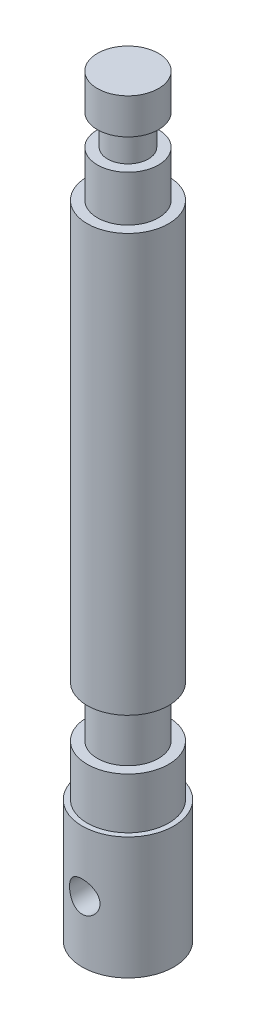
ISO-10303-21;
HEADER;
FILE_DESCRIPTION(('STEP AP214'),'2;1');
FILE_NAME('part.step','',(''),(''),'','','');
FILE_SCHEMA(('AUTOMOTIVE_DESIGN { 1 0 10303 214 1 1 1 1 }'));
ENDSEC;
DATA;
#1=APPLICATION_CONTEXT('core data for automotive mechanical design processes');
#2=APPLICATION_PROTOCOL_DEFINITION('international standard','automotive_design',2000,#1);
#3=PRODUCT_CONTEXT('',#1,'mechanical');
#4=PRODUCT('Part','Part','',(#3));
#5=PRODUCT_RELATED_PRODUCT_CATEGORY('part','',(#4));
#6=PRODUCT_DEFINITION_FORMATION('','',#4);
#7=PRODUCT_DEFINITION_CONTEXT('part definition',#1,'design');
#8=PRODUCT_DEFINITION('design','',#6,#7);
#9=PRODUCT_DEFINITION_SHAPE('','',#8);
#10=(LENGTH_UNIT() NAMED_UNIT(*) SI_UNIT(.MILLI.,.METRE.));
#11=(NAMED_UNIT(*) PLANE_ANGLE_UNIT() SI_UNIT($,.RADIAN.));
#12=(NAMED_UNIT(*) SI_UNIT($,.STERADIAN.) SOLID_ANGLE_UNIT());
#13=UNCERTAINTY_MEASURE_WITH_UNIT(LENGTH_MEASURE(1.E-05),#10,'distance_accuracy_value','');
#14=(GEOMETRIC_REPRESENTATION_CONTEXT(3) GLOBAL_UNCERTAINTY_ASSIGNED_CONTEXT((#13)) GLOBAL_UNIT_ASSIGNED_CONTEXT((#10,
#11,#12)) REPRESENTATION_CONTEXT('',''));
#15=CARTESIAN_POINT('',(0.,0.,0.));
#16=DIRECTION('',(0.,0.,1.));
#17=DIRECTION('',(1.,0.,0.));
#18=AXIS2_PLACEMENT_3D('',#15,#16,#17);
#19=CARTESIAN_POINT('',(0.,24.,0.));
#20=DIRECTION('',(0.,-1.,0.));
#21=DIRECTION('',(0.,0.,-1.));
#22=AXIS2_PLACEMENT_3D('',#19,#20,#21);
#23=CYLINDRICAL_SURFACE('',#22,9.);
#24=CARTESIAN_POINT('',(0.,15.,-9.));
#25=CARTESIAN_POINT('',(-0.16369008866017,15.0000007611949,-9.00000045902832));
#26=CARTESIAN_POINT('',(-0.32737558361565,14.9865592016184,-8.99549308522634));
#27=CARTESIAN_POINT('',(-0.649925282618917,14.9333126735483,-8.97795630609842));
#28=CARTESIAN_POINT('',(-0.808788984356453,14.8935049681532,-8.96492601606458));
#29=CARTESIAN_POINT('',(-1.11699836850533,14.7890422698479,-8.93175923719328));
#30=CARTESIAN_POINT('',(-1.2663594776581,14.7244288126222,-8.9116346319256));
#31=CARTESIAN_POINT('',(-1.55212481041597,14.572376481485,-8.86633337152025));
#32=CARTESIAN_POINT('',(-1.68852647087612,14.4849331049922,-8.84115572003334));
#33=CARTESIAN_POINT('',(-1.9492250250668,14.2865225854237,-8.78742283329015));
#34=CARTESIAN_POINT('',(-2.07301110089493,14.1749062972185,-8.75878669391354));
#35=CARTESIAN_POINT('',(-2.30049807810625,13.9326985358803,-8.70180944349364));
#36=CARTESIAN_POINT('',(-2.40419455646839,13.8021028952145,-8.67346839871647));
#37=CARTESIAN_POINT('',(-2.59147482668358,13.5210446544106,-8.61939997431821));
#38=CARTESIAN_POINT('',(-2.6743945746631,13.3701187808036,-8.59377117827064));
#39=CARTESIAN_POINT('',(-2.81345662163317,13.0554717166244,-8.54925916255803));
#40=CARTESIAN_POINT('',(-2.8696070921603,12.8917544485118,-8.53037388482237));
#41=CARTESIAN_POINT('',(-2.95162038452749,12.5619803355099,-8.50233909808132));
#42=CARTESIAN_POINT('',(-2.97844034481531,12.3961883745328,-8.49288287308834));
#43=CARTESIAN_POINT('',(-3.00402337000343,12.0622087375324,-8.48386969888523));
#44=CARTESIAN_POINT('',(-3.00279510481416,11.8940218178724,-8.4843096906819));
#45=CARTESIAN_POINT('',(-2.97305971111026,11.5681901086679,-8.4947704502454));
#46=CARTESIAN_POINT('',(-2.94580173950098,11.4104147912429,-8.50435247602599));
#47=CARTESIAN_POINT('',(-2.86681848854825,11.1018197411795,-8.53129973173653));
#48=CARTESIAN_POINT('',(-2.81509027977561,10.9510008436948,-8.54866589352323));
#49=CARTESIAN_POINT('',(-2.68781717418063,10.6577617512256,-8.58953733393746));
#50=CARTESIAN_POINT('',(-2.61190214612179,10.5155159235914,-8.61313697379352));
#51=CARTESIAN_POINT('',(-2.43866731890942,10.2453872751608,-8.66377675727179));
#52=CARTESIAN_POINT('',(-2.34134133709202,10.1175086191999,-8.69081789371391));
#53=CARTESIAN_POINT('',(-2.12204799804671,9.87272520551768,-8.74701987503223));
#54=CARTESIAN_POINT('',(-1.99905945022893,9.75674191647279,-8.77621768064528));
#55=CARTESIAN_POINT('',(-1.73501870991019,9.54680620000981,-8.8322081516111));
#56=CARTESIAN_POINT('',(-1.59396478698244,9.45285588550651,-8.85900058614202));
#57=CARTESIAN_POINT('',(-1.2958428391388,9.28891109929479,-8.90751323813381));
#58=CARTESIAN_POINT('',(-1.13862982924901,9.2191635259778,-8.92918050024118));
#59=CARTESIAN_POINT('',(-0.813807250093522,9.10739047813287,-8.96461701433304));
#60=CARTESIAN_POINT('',(-0.64620131446486,9.06535537372969,-8.97838900964638));
#61=CARTESIAN_POINT('',(-0.313151488587911,9.01183300193292,-8.99602881214321));
#62=CARTESIAN_POINT('',(-0.147928799594537,8.99910057248175,-9.00030005501184));
#63=CARTESIAN_POINT('',(0.182325209880714,9.00099802079541,-8.99966708084482));
#64=CARTESIAN_POINT('',(0.347356557958953,9.01562327993963,-8.99476441258087));
#65=CARTESIAN_POINT('',(0.667559598912768,9.07083572320788,-8.97660074151313));
#66=CARTESIAN_POINT('',(0.822878420504532,9.11065861814848,-8.96358596133577));
#67=CARTESIAN_POINT('',(1.12456787573872,9.21418033340019,-8.9307554049021));
#68=CARTESIAN_POINT('',(1.27093736552582,9.27788219840336,-8.91093876140025));
#69=CARTESIAN_POINT('',(1.55486488917982,9.42921129552236,-8.86586793861869));
#70=CARTESIAN_POINT('',(1.69208987765144,9.51742377984951,-8.84048444267358));
#71=CARTESIAN_POINT('',(1.95019449040676,9.71458245004045,-8.78715761748787));
#72=CARTESIAN_POINT('',(2.07106910338673,9.8235349680953,-8.75921350781483));
#73=CARTESIAN_POINT('',(2.2987575234189,10.0649362530198,-8.70230543941334));
#74=CARTESIAN_POINT('',(2.40468290773731,10.1982276807806,-8.67335283262283));
#75=CARTESIAN_POINT('',(2.59277256697072,10.4813147034327,-8.61899919884126));
#76=CARTESIAN_POINT('',(2.67493664379304,10.6311104359022,-8.59359820146007));
#77=CARTESIAN_POINT('',(2.81279079124908,10.9430190458697,-8.54947175374151));
#78=CARTESIAN_POINT('',(2.86853439649506,11.1051062375063,-8.53073282378936));
#79=CARTESIAN_POINT('',(2.95168400027807,11.4371359501324,-8.50232496919349));
#80=CARTESIAN_POINT('',(2.97910276486182,11.607074896213,-8.49265195870918));
#81=CARTESIAN_POINT('',(3.00382884743203,11.9405912881228,-8.48393576622531));
#82=CARTESIAN_POINT('',(3.0026107719252,12.1040470208605,-8.48437200772245));
#83=CARTESIAN_POINT('',(2.97372688034608,12.4282952247662,-8.49453809471602));
#84=CARTESIAN_POINT('',(2.94606263837576,12.5890878538653,-8.50426738708085));
#85=CARTESIAN_POINT('',(2.86611543938804,12.9004069890074,-8.53153572914675));
#86=CARTESIAN_POINT('',(2.81431003804654,13.0510704750135,-8.54892294067432));
#87=CARTESIAN_POINT('',(2.68793809727924,13.3416822208148,-8.58949196455405));
#88=CARTESIAN_POINT('',(2.61336650566142,13.481628093564,-8.61267506290179));
#89=CARTESIAN_POINT('',(2.43978207775029,13.7534510097687,-8.66348487678139));
#90=CARTESIAN_POINT('',(2.33984472829374,13.8847095056952,-8.69126134926411));
#91=CARTESIAN_POINT('',(2.11992864940695,14.1290694401526,-8.74750068849758));
#92=CARTESIAN_POINT('',(1.99994425335444,14.2421657270642,-8.77596374737117));
#93=CARTESIAN_POINT('',(1.73772467076206,14.4514332368675,-8.83170091576632));
#94=CARTESIAN_POINT('',(1.59480454049919,14.546773043253,-8.8588854540377));
#95=CARTESIAN_POINT('',(1.29407207221987,14.7119712865519,-8.90777973517836));
#96=CARTESIAN_POINT('',(1.13626355439704,14.7818362377661,-8.9294908772379));
#97=CARTESIAN_POINT('',(0.817480941602927,14.891164897466,-8.96416545205626));
#98=CARTESIAN_POINT('',(0.656963273029226,14.9318473987901,-8.97747637267568));
#99=CARTESIAN_POINT('',(0.330961248030742,14.9862608420314,-8.99539221192665));
#100=CARTESIAN_POINT('',(0.16547827670624,14.9999992304896,-8.99999953595715));
#101=CARTESIAN_POINT('',(0.,15.,-9.));
#102=B_SPLINE_CURVE_WITH_KNOTS('',3,(#24,#25,#26,#27,#28,#29,#30,#31,#32,#33,#34,#35,#36,#37,
#38,#39,#40,#41,#42,#43,#44,#45,#46,#47,#48,#49,#50,#51,#52,#53,#54,#55,#56,#57,#58,#59,#60,#61,
#62,#63,#64,#65,#66,#67,#68,#69,#70,#71,#72,#73,#74,#75,#76,#77,#78,#79,#80,#81,#82,#83,#84,#85,
#86,#87,#88,#89,#90,#91,#92,#93,#94,#95,#96,#97,#98,#99,#100,#101),.UNSPECIFIED.,.T.,.F.,(4,2,2,
2,2,2,2,2,2,2,2,2,2,2,2,2,2,2,2,2,2,2,2,2,2,2,2,2,2,2,2,2,2,2,2,2,2,2,4),(0.,0.490461318078033,
0.980973555802562,1.47066801861082,1.9604591333973,2.46554052848268,2.97073299862591,
3.49045154470412,4.010011340785,4.5120577722552,5.01394901962456,5.49290479653841,
5.97191792566446,6.45864513465392,6.94551307674622,7.45779917434101,7.97013437899855,
8.48755216951073,9.00479006631625,9.49960749525509,9.9943413949253,10.4747447393464,
10.9552093585231,11.4483119953121,11.9415654246567,12.4572306864226,12.9729002470499,
13.4875204148031,14.0019085411752,14.4898699819277,14.9778023805413,15.4564676124125,
15.9352391452793,16.4349020007541,16.9347063337134,17.453989825053,17.9731404345737,
18.4690967512144,18.9649159811442),.UNSPECIFIED.);
#103=CARTESIAN_POINT('',(0.,15.,-9.));
#104=VERTEX_POINT('',#103);
#105=EDGE_CURVE('E10',#104,#104,#102,.T.);
#106=ORIENTED_EDGE('',*,*,#105,.T.);
#107=EDGE_LOOP('',(#106));
#108=FACE_BOUND('',#107,.T.);
#109=CARTESIAN_POINT('',(3.,12.,8.48528137423857));
#110=CARTESIAN_POINT('',(3.00000077384314,11.8365954754918,8.48528083591302));
#111=CARTESIAN_POINT('',(2.98660435105657,11.6731956005292,8.49005307872572));
#112=CARTESIAN_POINT('',(2.93355339506643,11.3512367370173,8.50852722243764));
#113=CARTESIAN_POINT('',(2.89389453650519,11.1926785503826,8.52223059426566));
#114=CARTESIAN_POINT('',(2.78986645705471,10.8851193210081,8.55684611066375));
#115=CARTESIAN_POINT('',(2.72554566420974,10.7361002116718,8.57774411913965));
#116=CARTESIAN_POINT('',(2.57418488532414,10.4509198543561,8.62437366030974));
#117=CARTESIAN_POINT('',(2.48713988658055,10.3147614523391,8.65010625910837));
#118=CARTESIAN_POINT('',(2.28915343932863,10.0538401129851,8.70463468222419));
#119=CARTESIAN_POINT('',(2.17747302413376,9.92965371398481,8.73350684533932));
#120=CARTESIAN_POINT('',(1.93496300164318,9.70137959632608,8.79041594403009));
#121=CARTESIAN_POINT('',(1.80413032515713,9.59729510525289,8.81845274486885));
#122=CARTESIAN_POINT('',(1.52281352389503,9.40956330801122,8.87141600765397));
#123=CARTESIAN_POINT('',(1.37190573367357,9.32652008814613,8.89624223104816));
#124=CARTESIAN_POINT('',(1.05729366896242,9.18722524461747,8.93908760312949));
#125=CARTESIAN_POINT('',(0.893592857061635,9.13096640046928,8.95710858609006));
#126=CARTESIAN_POINT('',(0.564086452300483,9.04879243610282,8.9837722629572));
#127=CARTESIAN_POINT('',(0.398552264558905,9.02188966122898,8.99271944332677));
#128=CARTESIAN_POINT('',(0.0650936244722681,8.99605111991802,9.00130824654744));
#129=CARTESIAN_POINT('',(-0.10283020063169,8.99710814504276,9.00095226788686));
#130=CARTESIAN_POINT('',(-0.429310545581445,9.02653276369808,8.99118118856194));
#131=CARTESIAN_POINT('',(-0.58797614577497,9.05382758542346,8.98212194265352));
#132=CARTESIAN_POINT('',(-0.898330316466515,9.13317894294142,8.95640902019194));
#133=CARTESIAN_POINT('',(-1.05001841333765,9.18523715693947,8.93975482893545));
#134=CARTESIAN_POINT('',(-1.34445742452592,9.31326395191818,8.90027010879673));
#135=CARTESIAN_POINT('',(-1.48706466290653,9.38953781563954,8.87736127572046));
#136=CARTESIAN_POINT('',(-1.75777297658197,9.56357911634597,8.82775179116757));
#137=CARTESIAN_POINT('',(-1.88587000315602,9.66135252998289,8.801050086044));
#138=CARTESIAN_POINT('',(-2.13030259965392,9.8810231803791,8.7451857554969));
#139=CARTESIAN_POINT('',(-2.24580047119582,10.0038394735244,8.71596645506633));
#140=CARTESIAN_POINT('',(-2.45483177879452,10.2673461771799,8.65942005746702));
#141=CARTESIAN_POINT('',(-2.54836182984463,10.4080393371841,8.63209325236846));
#142=CARTESIAN_POINT('',(-2.71196236510723,10.7059608768103,8.58211575363337));
#143=CARTESIAN_POINT('',(-2.78167939086402,10.8633963939533,8.55953727854243));
#144=CARTESIAN_POINT('',(-2.89332957980801,11.1887141826433,8.52244952473154));
#145=CARTESIAN_POINT('',(-2.93527438724248,11.3565920436187,8.50793686461278));
#146=CARTESIAN_POINT('',(-2.98848384629256,11.6899150662347,8.48938908946755));
#147=CARTESIAN_POINT('',(-3.0010472865229,11.855128274246,8.48491080956268));
#148=CARTESIAN_POINT('',(-2.99881631672916,12.1853284473423,8.48570016177553));
#149=CARTESIAN_POINT('',(-2.98402687568029,12.350315448072,8.49096602375443));
#150=CARTESIAN_POINT('',(-2.92867695465693,12.6694708971357,8.51020854270898));
#151=CARTESIAN_POINT('',(-2.88901918194205,12.8238162904525,8.52387976322521));
#152=CARTESIAN_POINT('',(-2.7861415876814,13.1236308187176,8.55805661013069));
#153=CARTESIAN_POINT('',(-2.72291758909027,13.2690983747723,8.57856344804518));
#154=CARTESIAN_POINT('',(-2.57242302221681,13.552141262541,8.6249063278736));
#155=CARTESIAN_POINT('',(-2.48445335507549,13.6893199279254,8.65089076996885));
#156=CARTESIAN_POINT('',(-2.28775689167268,13.9474381571512,8.70497306192896));
#157=CARTESIAN_POINT('',(-2.17902397649635,14.0683729159837,8.73307153331383));
#158=CARTESIAN_POINT('',(-1.93767511770098,14.2965839522719,8.78985115913547));
#159=CARTESIAN_POINT('',(-1.80416181163996,14.4029231700565,8.81849530733689));
#160=CARTESIAN_POINT('',(-1.52048187420077,14.5917484270441,8.87180554839326));
#161=CARTESIAN_POINT('',(-1.37031583459366,14.6742353134873,8.89647178253084));
#162=CARTESIAN_POINT('',(-1.05833958729689,14.8122603145851,8.93893217431809));
#163=CARTESIAN_POINT('',(-0.896613369963591,14.8679738314442,8.95677090013593));
#164=CARTESIAN_POINT('',(-0.56537539753805,14.9511832261803,8.98375832513324));
#165=CARTESIAN_POINT('',(-0.395866475861669,14.9786892896415,8.99291016102056));
#166=CARTESIAN_POINT('',(-0.0624460075801243,15.0037862328169,9.00125589708769));
#167=CARTESIAN_POINT('',(0.101354171760054,15.0027223617971,9.00089760268317));
#168=CARTESIAN_POINT('',(0.42633343500052,14.9740280755608,8.99136589558194));
#169=CARTESIAN_POINT('',(0.587512730457169,14.9463998155417,8.98219319800727));
#170=CARTESIAN_POINT('',(0.900126358296175,14.8662532962721,8.95622744863237));
#171=CARTESIAN_POINT('',(1.05167481273837,14.8141373539412,8.93955775083445));
#172=CARTESIAN_POINT('',(1.34393505281939,14.6868674067085,8.90031482113485));
#173=CARTESIAN_POINT('',(1.4846448724273,14.611709234409,8.87774052144049));
#174=CARTESIAN_POINT('',(1.75690204892636,14.437291463694,8.82797606483643));
#175=CARTESIAN_POINT('',(1.88791875467282,14.3372439438551,8.80064617475779));
#176=CARTESIAN_POINT('',(2.13174307881728,14.1172278265314,8.74478966375638));
#177=CARTESIAN_POINT('',(2.24454486487378,13.9972528732118,8.71626266319291));
#178=CARTESIAN_POINT('',(2.45322542649935,13.7351719332392,8.65989839476794));
#179=CARTESIAN_POINT('',(2.5482688979937,13.5923834670701,8.63213183965892));
#180=CARTESIAN_POINT('',(2.71294302990334,13.2919967192917,8.58180579969046));
#181=CARTESIAN_POINT('',(2.78258033045842,13.134402320911,8.55924495483748));
#182=CARTESIAN_POINT('',(2.8915314846125,12.8161145279531,8.52304002619544));
#183=CARTESIAN_POINT('',(2.93207372744856,12.6558832094239,8.50903898571547));
#184=CARTESIAN_POINT('',(2.9863029604478,12.3304318485999,8.49016150618554));
#185=CARTESIAN_POINT('',(2.99999921758978,12.1652135477679,8.48528191852383));
#186=CARTESIAN_POINT('',(3.,12.,8.48528137423857));
#187=B_SPLINE_CURVE_WITH_KNOTS('',3,(#109,#110,#111,#112,#113,#114,#115,#116,#117,#118,#119,
#120,#121,#122,#123,#124,#125,#126,#127,#128,#129,#130,#131,#132,#133,#134,#135,#136,#137,#138,
#139,#140,#141,#142,#143,#144,#145,#146,#147,#148,#149,#150,#151,#152,#153,#154,#155,#156,#157,
#158,#159,#160,#161,#162,#163,#164,#165,#166,#167,#168,#169,#170,#171,#172,#173,#174,#175,#176,
#177,#178,#179,#180,#181,#182,#183,#184,#185,#186),.UNSPECIFIED.,.T.,.F.,(4,2,2,2,2,2,2,2,2,2,2,
2,2,2,2,2,2,2,2,2,2,2,2,2,2,2,2,2,2,2,2,2,2,2,2,2,2,2,4),(0.,0.489601754398066,
0.979284165045492,1.46800988250249,1.95684349855633,2.46304012282705,2.96931795515964,
3.48880518430972,4.00815229160367,4.50942956294803,5.01057759906982,5.49207014476707,
5.9735953256771,6.46144964581005,6.94943975622066,7.46040523091753,7.97144938836318,
8.48977919529167,9.00789154069847,9.50262874093318,9.99727607511701,10.4749318730633,
10.9526723744084,11.4455657320714,11.9386045698638,12.4553642451328,12.972105562726,
13.4854137357255,13.9985364901247,14.4875425403291,14.9765089202934,15.4577086812129,
15.9389955228973,16.438065585619,16.9372951329789,17.4560670820843,17.974703348006,
18.4698963648807,18.9649184157139),.UNSPECIFIED.);
#188=CARTESIAN_POINT('',(3.,12.,8.48528137423857));
#189=VERTEX_POINT('',#188);
#190=EDGE_CURVE('E46',#189,#189,#187,.T.);
#191=ORIENTED_EDGE('',*,*,#190,.T.);
#192=EDGE_LOOP('',(#191));
#193=FACE_BOUND('',#192,.T.);
#194=CARTESIAN_POINT('',(0.,24.,0.));
#195=DIRECTION('',(0.,1.,0.));
#196=DIRECTION('',(0.,0.,1.));
#197=AXIS2_PLACEMENT_3D('',#194,#195,#196);
#198=CIRCLE('',#197,9.);
#199=CARTESIAN_POINT('',(0.,24.,9.));
#200=VERTEX_POINT('',#199);
#201=EDGE_CURVE('E132',#200,#200,#198,.T.);
#202=ORIENTED_EDGE('',*,*,#201,.F.);
#203=EDGE_LOOP('',(#202));
#204=FACE_BOUND('',#203,.T.);
#205=CARTESIAN_POINT('',(0.,0.,0.));
#206=DIRECTION('',(0.,1.,0.));
#207=DIRECTION('',(0.,0.,1.));
#208=AXIS2_PLACEMENT_3D('',#205,#206,#207);
#209=CIRCLE('',#208,9.);
#210=CARTESIAN_POINT('',(0.,0.,9.));
#211=VERTEX_POINT('',#210);
#212=EDGE_CURVE('E60',#211,#211,#209,.T.);
#213=ORIENTED_EDGE('',*,*,#212,.T.);
#214=EDGE_LOOP('',(#213));
#215=FACE_BOUND('',#214,.T.);
#216=ADVANCED_FACE('F35',(#108,#193,#204,#215),#23,.T.);
#217=CARTESIAN_POINT('',(0.,24.,0.));
#218=DIRECTION('',(0.,1.,0.));
#219=DIRECTION('',(0.,0.,1.));
#220=AXIS2_PLACEMENT_3D('',#217,#218,#219);
#221=PLANE('',#220);
#222=CARTESIAN_POINT('',(0.,24.,0.));
#223=DIRECTION('',(0.,1.,0.));
#224=DIRECTION('',(0.,0.,1.));
#225=AXIS2_PLACEMENT_3D('',#222,#223,#224);
#226=CIRCLE('',#225,8.);
#227=CARTESIAN_POINT('',(0.,24.,8.));
#228=VERTEX_POINT('',#227);
#229=EDGE_CURVE('E135',#228,#228,#226,.T.);
#230=ORIENTED_EDGE('',*,*,#229,.F.);
#231=EDGE_LOOP('',(#230));
#232=FACE_BOUND('',#231,.T.);
#233=ORIENTED_EDGE('',*,*,#201,.T.);
#234=EDGE_LOOP('',(#233));
#235=FACE_BOUND('',#234,.T.);
#236=ADVANCED_FACE('F117',(#232,#235),#221,.T.);
#237=CARTESIAN_POINT('',(0.,0.,0.));
#238=DIRECTION('',(0.,1.,0.));
#239=DIRECTION('',(0.,0.,1.));
#240=AXIS2_PLACEMENT_3D('',#237,#238,#239);
#241=PLANE('',#240);
#242=ORIENTED_EDGE('',*,*,#212,.F.);
#243=EDGE_LOOP('',(#242));
#244=FACE_BOUND('',#243,.T.);
#245=ADVANCED_FACE('F115',(#244),#241,.F.);
#246=CARTESIAN_POINT('',(0.,34.,0.));
#247=DIRECTION('',(0.,-1.,0.));
#248=DIRECTION('',(0.,0.,-1.));
#249=AXIS2_PLACEMENT_3D('',#246,#247,#248);
#250=CYLINDRICAL_SURFACE('',#249,8.);
#251=CARTESIAN_POINT('',(0.,34.,0.));
#252=DIRECTION('',(0.,1.,0.));
#253=DIRECTION('',(0.,0.,1.));
#254=AXIS2_PLACEMENT_3D('',#251,#252,#253);
#255=CIRCLE('',#254,8.);
#256=CARTESIAN_POINT('',(0.,34.,8.));
#257=VERTEX_POINT('',#256);
#258=EDGE_CURVE('E134',#257,#257,#255,.T.);
#259=ORIENTED_EDGE('',*,*,#258,.F.);
#260=EDGE_LOOP('',(#259));
#261=FACE_BOUND('',#260,.T.);
#262=ORIENTED_EDGE('',*,*,#229,.T.);
#263=EDGE_LOOP('',(#262));
#264=FACE_BOUND('',#263,.T.);
#265=ADVANCED_FACE('F111',(#261,#264),#250,.T.);
#266=CARTESIAN_POINT('',(0.,34.,0.));
#267=DIRECTION('',(0.,1.,0.));
#268=DIRECTION('',(0.,0.,1.));
#269=AXIS2_PLACEMENT_3D('',#266,#267,#268);
#270=PLANE('',#269);
#271=CARTESIAN_POINT('',(0.,34.,0.));
#272=DIRECTION('',(0.,1.,0.));
#273=DIRECTION('',(0.,0.,1.));
#274=AXIS2_PLACEMENT_3D('',#271,#272,#273);
#275=CIRCLE('',#274,6.);
#276=CARTESIAN_POINT('',(0.,34.,6.));
#277=VERTEX_POINT('',#276);
#278=EDGE_CURVE('E146',#277,#277,#275,.T.);
#279=ORIENTED_EDGE('',*,*,#278,.F.);
#280=EDGE_LOOP('',(#279));
#281=FACE_BOUND('',#280,.T.);
#282=ORIENTED_EDGE('',*,*,#258,.T.);
#283=EDGE_LOOP('',(#282));
#284=FACE_BOUND('',#283,.T.);
#285=ADVANCED_FACE('F107',(#281,#284),#270,.T.);
#286=CARTESIAN_POINT('',(0.,44.,0.));
#287=DIRECTION('',(0.,-1.,0.));
#288=DIRECTION('',(0.,0.,-1.));
#289=AXIS2_PLACEMENT_3D('',#286,#287,#288);
#290=CYLINDRICAL_SURFACE('',#289,6.);
#291=CARTESIAN_POINT('',(0.,44.,0.));
#292=DIRECTION('',(0.,1.,0.));
#293=DIRECTION('',(0.,0.,1.));
#294=AXIS2_PLACEMENT_3D('',#291,#292,#293);
#295=CIRCLE('',#294,6.);
#296=CARTESIAN_POINT('',(0.,44.,6.));
#297=VERTEX_POINT('',#296);
#298=EDGE_CURVE('E137',#297,#297,#295,.T.);
#299=ORIENTED_EDGE('',*,*,#298,.F.);
#300=EDGE_LOOP('',(#299));
#301=FACE_BOUND('',#300,.T.);
#302=ORIENTED_EDGE('',*,*,#278,.T.);
#303=EDGE_LOOP('',(#302));
#304=FACE_BOUND('',#303,.T.);
#305=ADVANCED_FACE('F103',(#301,#304),#290,.T.);
#306=CARTESIAN_POINT('',(0.,126.,0.));
#307=DIRECTION('',(0.,-1.,0.));
#308=DIRECTION('',(0.,0.,-1.));
#309=AXIS2_PLACEMENT_3D('',#306,#307,#308);
#310=CYLINDRICAL_SURFACE('',#309,8.);
#311=CARTESIAN_POINT('',(0.,126.,0.));
#312=DIRECTION('',(0.,1.,0.));
#313=DIRECTION('',(0.,0.,1.));
#314=AXIS2_PLACEMENT_3D('',#311,#312,#313);
#315=CIRCLE('',#314,8.);
#316=CARTESIAN_POINT('',(0.,126.,8.));
#317=VERTEX_POINT('',#316);
#318=EDGE_CURVE('E142',#317,#317,#315,.T.);
#319=ORIENTED_EDGE('',*,*,#318,.F.);
#320=EDGE_LOOP('',(#319));
#321=FACE_BOUND('',#320,.T.);
#322=CARTESIAN_POINT('',(0.,44.,0.));
#323=DIRECTION('',(0.,1.,0.));
#324=DIRECTION('',(0.,0.,1.));
#325=AXIS2_PLACEMENT_3D('',#322,#323,#324);
#326=CIRCLE('',#325,8.);
#327=CARTESIAN_POINT('',(0.,44.,8.));
#328=VERTEX_POINT('',#327);
#329=EDGE_CURVE('E162',#328,#328,#326,.T.);
#330=ORIENTED_EDGE('',*,*,#329,.T.);
#331=EDGE_LOOP('',(#330));
#332=FACE_BOUND('',#331,.T.);
#333=ADVANCED_FACE('F96',(#321,#332),#310,.T.);
#334=CARTESIAN_POINT('',(0.,126.,0.));
#335=DIRECTION('',(0.,1.,0.));
#336=DIRECTION('',(0.,0.,1.));
#337=AXIS2_PLACEMENT_3D('',#334,#335,#336);
#338=PLANE('',#337);
#339=CARTESIAN_POINT('',(0.,126.,0.));
#340=DIRECTION('',(0.,1.,0.));
#341=DIRECTION('',(0.,0.,1.));
#342=AXIS2_PLACEMENT_3D('',#339,#340,#341);
#343=CIRCLE('',#342,6.);
#344=CARTESIAN_POINT('',(0.,126.,6.));
#345=VERTEX_POINT('',#344);
#346=EDGE_CURVE('E54',#345,#345,#343,.T.);
#347=ORIENTED_EDGE('',*,*,#346,.F.);
#348=EDGE_LOOP('',(#347));
#349=FACE_BOUND('',#348,.T.);
#350=ORIENTED_EDGE('',*,*,#318,.T.);
#351=EDGE_LOOP('',(#350));
#352=FACE_BOUND('',#351,.T.);
#353=ADVANCED_FACE('F93',(#349,#352),#338,.T.);
#354=CARTESIAN_POINT('',(0.,44.,0.));
#355=DIRECTION('',(0.,1.,0.));
#356=DIRECTION('',(0.,0.,1.));
#357=AXIS2_PLACEMENT_3D('',#354,#355,#356);
#358=PLANE('',#357);
#359=ORIENTED_EDGE('',*,*,#298,.T.);
#360=EDGE_LOOP('',(#359));
#361=FACE_BOUND('',#360,.T.);
#362=ORIENTED_EDGE('',*,*,#329,.F.);
#363=EDGE_LOOP('',(#362));
#364=FACE_BOUND('',#363,.T.);
#365=ADVANCED_FACE('F91',(#361,#364),#358,.F.);
#366=CARTESIAN_POINT('',(0.,135.,0.));
#367=DIRECTION('',(0.,-1.,0.));
#368=DIRECTION('',(0.,0.,-1.));
#369=AXIS2_PLACEMENT_3D('',#366,#367,#368);
#370=CYLINDRICAL_SURFACE('',#369,6.);
#371=CARTESIAN_POINT('',(0.,135.,0.));
#372=DIRECTION('',(0.,1.,0.));
#373=DIRECTION('',(0.,0.,1.));
#374=AXIS2_PLACEMENT_3D('',#371,#372,#373);
#375=CIRCLE('',#374,6.);
#376=CARTESIAN_POINT('',(0.,135.,6.));
#377=VERTEX_POINT('',#376);
#378=EDGE_CURVE('E159',#377,#377,#375,.T.);
#379=ORIENTED_EDGE('',*,*,#378,.F.);
#380=EDGE_LOOP('',(#379));
#381=FACE_BOUND('',#380,.T.);
#382=ORIENTED_EDGE('',*,*,#346,.T.);
#383=EDGE_LOOP('',(#382));
#384=FACE_BOUND('',#383,.T.);
#385=ADVANCED_FACE('F87',(#381,#384),#370,.T.);
#386=CARTESIAN_POINT('',(0.,135.,0.));
#387=DIRECTION('',(0.,1.,0.));
#388=DIRECTION('',(0.,0.,1.));
#389=AXIS2_PLACEMENT_3D('',#386,#387,#388);
#390=PLANE('',#389);
#391=CARTESIAN_POINT('',(0.,135.,0.));
#392=DIRECTION('',(0.,1.,0.));
#393=DIRECTION('',(0.,0.,1.));
#394=AXIS2_PLACEMENT_3D('',#391,#392,#393);
#395=CIRCLE('',#394,4.);
#396=CARTESIAN_POINT('',(0.,135.,4.));
#397=VERTEX_POINT('',#396);
#398=EDGE_CURVE('E50',#397,#397,#395,.T.);
#399=ORIENTED_EDGE('',*,*,#398,.F.);
#400=EDGE_LOOP('',(#399));
#401=FACE_BOUND('',#400,.T.);
#402=ORIENTED_EDGE('',*,*,#378,.T.);
#403=EDGE_LOOP('',(#402));
#404=FACE_BOUND('',#403,.T.);
#405=ADVANCED_FACE('F83',(#401,#404),#390,.T.);
#406=CARTESIAN_POINT('',(0.,141.,0.));
#407=DIRECTION('',(0.,-1.,0.));
#408=DIRECTION('',(0.,0.,-1.));
#409=AXIS2_PLACEMENT_3D('',#406,#407,#408);
#410=CYLINDRICAL_SURFACE('',#409,4.);
#411=CARTESIAN_POINT('',(0.,141.,0.));
#412=DIRECTION('',(0.,1.,0.));
#413=DIRECTION('',(0.,0.,1.));
#414=AXIS2_PLACEMENT_3D('',#411,#412,#413);
#415=CIRCLE('',#414,4.);
#416=CARTESIAN_POINT('',(0.,141.,4.));
#417=VERTEX_POINT('',#416);
#418=EDGE_CURVE('E167',#417,#417,#415,.T.);
#419=ORIENTED_EDGE('',*,*,#418,.F.);
#420=EDGE_LOOP('',(#419));
#421=FACE_BOUND('',#420,.T.);
#422=ORIENTED_EDGE('',*,*,#398,.T.);
#423=EDGE_LOOP('',(#422));
#424=FACE_BOUND('',#423,.T.);
#425=ADVANCED_FACE('F79',(#421,#424),#410,.T.);
#426=CARTESIAN_POINT('',(0.,148.,0.));
#427=DIRECTION('',(0.,-1.,0.));
#428=DIRECTION('',(0.,0.,-1.));
#429=AXIS2_PLACEMENT_3D('',#426,#427,#428);
#430=CYLINDRICAL_SURFACE('',#429,6.);
#431=CARTESIAN_POINT('',(0.,148.,0.));
#432=DIRECTION('',(0.,1.,0.));
#433=DIRECTION('',(0.,0.,1.));
#434=AXIS2_PLACEMENT_3D('',#431,#432,#433);
#435=CIRCLE('',#434,6.);
#436=CARTESIAN_POINT('',(0.,148.,6.));
#437=VERTEX_POINT('',#436);
#438=EDGE_CURVE('E171',#437,#437,#435,.T.);
#439=ORIENTED_EDGE('',*,*,#438,.F.);
#440=EDGE_LOOP('',(#439));
#441=FACE_BOUND('',#440,.T.);
#442=CARTESIAN_POINT('',(0.,141.,0.));
#443=DIRECTION('',(0.,1.,0.));
#444=DIRECTION('',(0.,0.,1.));
#445=AXIS2_PLACEMENT_3D('',#442,#443,#444);
#446=CIRCLE('',#445,6.);
#447=CARTESIAN_POINT('',(0.,141.,6.));
#448=VERTEX_POINT('',#447);
#449=EDGE_CURVE('E175',#448,#448,#446,.T.);
#450=ORIENTED_EDGE('',*,*,#449,.T.);
#451=EDGE_LOOP('',(#450));
#452=FACE_BOUND('',#451,.T.);
#453=ADVANCED_FACE('F72',(#441,#452),#430,.T.);
#454=CARTESIAN_POINT('',(0.,148.,0.));
#455=DIRECTION('',(0.,1.,0.));
#456=DIRECTION('',(0.,0.,1.));
#457=AXIS2_PLACEMENT_3D('',#454,#455,#456);
#458=PLANE('',#457);
#459=ORIENTED_EDGE('',*,*,#438,.T.);
#460=EDGE_LOOP('',(#459));
#461=FACE_BOUND('',#460,.T.);
#462=ADVANCED_FACE('F68',(#461),#458,.T.);
#463=CARTESIAN_POINT('',(0.,141.,0.));
#464=DIRECTION('',(0.,1.,0.));
#465=DIRECTION('',(0.,0.,1.));
#466=AXIS2_PLACEMENT_3D('',#463,#464,#465);
#467=PLANE('',#466);
#468=ORIENTED_EDGE('',*,*,#418,.T.);
#469=EDGE_LOOP('',(#468));
#470=FACE_BOUND('',#469,.T.);
#471=ORIENTED_EDGE('',*,*,#449,.F.);
#472=EDGE_LOOP('',(#471));
#473=FACE_BOUND('',#472,.T.);
#474=ADVANCED_FACE('F66',(#470,#473),#467,.F.);
#475=CARTESIAN_POINT('',(0.,12.,-9.));
#476=DIRECTION('',(0.,0.,1.));
#477=DIRECTION('',(1.,0.,0.));
#478=AXIS2_PLACEMENT_3D('',#475,#476,#477);
#479=CYLINDRICAL_SURFACE('',#478,3.);
#480=ORIENTED_EDGE('',*,*,#190,.F.);
#481=EDGE_LOOP('',(#480));
#482=FACE_BOUND('',#481,.T.);
#483=ORIENTED_EDGE('',*,*,#105,.F.);
#484=EDGE_LOOP('',(#483));
#485=FACE_BOUND('',#484,.T.);
#486=ADVANCED_FACE('F62',(#482,#485),#479,.F.);
#487=CLOSED_SHELL('',(#216,#236,#245,#265,#285,#305,#333,#353,#365,#385,#405,#425,#453,#462,
#474,#486));
#488=MANIFOLD_SOLID_BREP('B2',#487);
#489=ADVANCED_BREP_SHAPE_REPRESENTATION('',(#18,#488),#14);
#490=SHAPE_DEFINITION_REPRESENTATION(#9,#489);
ENDSEC;
END-ISO-10303-21;
